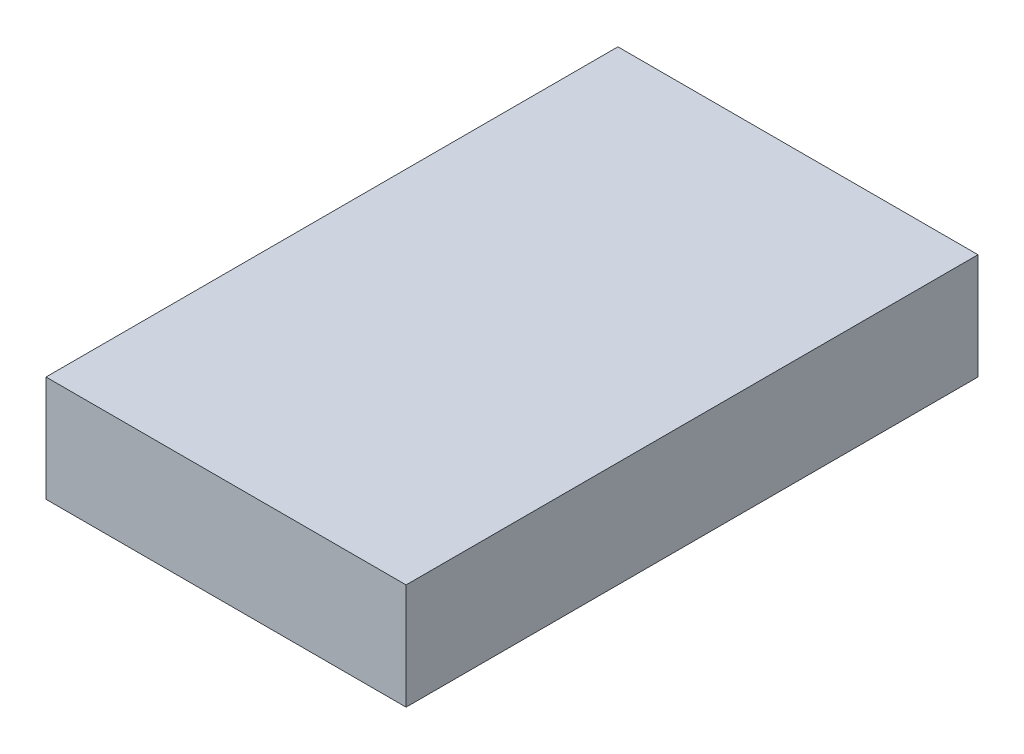
ISO-10303-21;
HEADER;
FILE_DESCRIPTION(('STEP AP214'),'2;1');
FILE_NAME('part.step','',(''),(''),'','','');
FILE_SCHEMA(('AUTOMOTIVE_DESIGN { 1 0 10303 214 1 1 1 1 }'));
ENDSEC;
DATA;
#1=APPLICATION_CONTEXT('core data for automotive mechanical design processes');
#2=APPLICATION_PROTOCOL_DEFINITION('international standard','automotive_design',2000,#1);
#3=PRODUCT_CONTEXT('',#1,'mechanical');
#4=PRODUCT('Part','Part','',(#3));
#5=PRODUCT_RELATED_PRODUCT_CATEGORY('part','',(#4));
#6=PRODUCT_DEFINITION_FORMATION('','',#4);
#7=PRODUCT_DEFINITION_CONTEXT('part definition',#1,'design');
#8=PRODUCT_DEFINITION('design','',#6,#7);
#9=PRODUCT_DEFINITION_SHAPE('','',#8);
#10=(LENGTH_UNIT() NAMED_UNIT(*) SI_UNIT(.MILLI.,.METRE.));
#11=(NAMED_UNIT(*) PLANE_ANGLE_UNIT() SI_UNIT($,.RADIAN.));
#12=(NAMED_UNIT(*) SI_UNIT($,.STERADIAN.) SOLID_ANGLE_UNIT());
#13=UNCERTAINTY_MEASURE_WITH_UNIT(LENGTH_MEASURE(1.E-05),#10,'distance_accuracy_value','');
#14=(GEOMETRIC_REPRESENTATION_CONTEXT(3) GLOBAL_UNCERTAINTY_ASSIGNED_CONTEXT((#13)) GLOBAL_UNIT_ASSIGNED_CONTEXT((#10,
#11,#12)) REPRESENTATION_CONTEXT('',''));
#15=CARTESIAN_POINT('',(0.,0.,0.));
#16=DIRECTION('',(0.,0.,1.));
#17=DIRECTION('',(1.,0.,0.));
#18=AXIS2_PLACEMENT_3D('',#15,#16,#17);
#19=CARTESIAN_POINT('',(0.68,0.4,-1.08));
#20=DIRECTION('',(-1.,0.,0.));
#21=DIRECTION('',(0.,0.,1.));
#22=AXIS2_PLACEMENT_3D('',#19,#20,#21);
#23=PLANE('',#22);
#24=DIRECTION('',(0.,0.,-1.));
#25=VECTOR('',#24,1.);
#26=CARTESIAN_POINT('',(0.68,0.,-1.08));
#27=LINE('',#26,#25);
#28=CARTESIAN_POINT('',(0.68,0.,1.08));
#29=VERTEX_POINT('',#28);
#30=CARTESIAN_POINT('',(0.68,0.,-1.08));
#31=VERTEX_POINT('',#30);
#32=EDGE_CURVE('E99',#29,#31,#27,.T.);
#33=ORIENTED_EDGE('',*,*,#32,.T.);
#34=DIRECTION('',(0.,-1.,0.));
#35=VECTOR('',#34,1.);
#36=CARTESIAN_POINT('',(0.68,0.4,-1.08));
#37=LINE('',#36,#35);
#38=CARTESIAN_POINT('',(0.68,0.4,-1.08));
#39=VERTEX_POINT('',#38);
#40=EDGE_CURVE('E11',#39,#31,#37,.T.);
#41=ORIENTED_EDGE('',*,*,#40,.F.);
#42=DIRECTION('',(0.,0.,-1.));
#43=VECTOR('',#42,1.);
#44=CARTESIAN_POINT('',(0.68,0.4,-1.08));
#45=LINE('',#44,#43);
#46=CARTESIAN_POINT('',(0.68,0.4,1.08));
#47=VERTEX_POINT('',#46);
#48=EDGE_CURVE('E87',#47,#39,#45,.T.);
#49=ORIENTED_EDGE('',*,*,#48,.F.);
#50=DIRECTION('',(0.,-1.,0.));
#51=VECTOR('',#50,1.);
#52=CARTESIAN_POINT('',(0.68,0.4,1.08));
#53=LINE('',#52,#51);
#54=EDGE_CURVE('E95',#47,#29,#53,.T.);
#55=ORIENTED_EDGE('',*,*,#54,.T.);
#56=EDGE_LOOP('',(#33,#41,#49,#55));
#57=FACE_BOUND('',#56,.T.);
#58=ADVANCED_FACE('F36',(#57),#23,.F.);
#59=CARTESIAN_POINT('',(-0.68,0.4,-1.08));
#60=DIRECTION('',(0.,0.,1.));
#61=DIRECTION('',(1.,0.,0.));
#62=AXIS2_PLACEMENT_3D('',#59,#60,#61);
#63=PLANE('',#62);
#64=DIRECTION('',(-1.,0.,0.));
#65=VECTOR('',#64,1.);
#66=CARTESIAN_POINT('',(-0.68,0.,-1.08));
#67=LINE('',#66,#65);
#68=CARTESIAN_POINT('',(-0.68,0.,-1.08));
#69=VERTEX_POINT('',#68);
#70=EDGE_CURVE('E91',#31,#69,#67,.T.);
#71=ORIENTED_EDGE('',*,*,#70,.T.);
#72=DIRECTION('',(0.,-1.,0.));
#73=VECTOR('',#72,1.);
#74=CARTESIAN_POINT('',(-0.68,0.4,-1.08));
#75=LINE('',#74,#73);
#76=CARTESIAN_POINT('',(-0.68,0.4,-1.08));
#77=VERTEX_POINT('',#76);
#78=EDGE_CURVE('E44',#77,#69,#75,.T.);
#79=ORIENTED_EDGE('',*,*,#78,.F.);
#80=DIRECTION('',(-1.,0.,0.));
#81=VECTOR('',#80,1.);
#82=CARTESIAN_POINT('',(-0.68,0.4,-1.08));
#83=LINE('',#82,#81);
#84=EDGE_CURVE('E82',#39,#77,#83,.T.);
#85=ORIENTED_EDGE('',*,*,#84,.F.);
#86=ORIENTED_EDGE('',*,*,#40,.T.);
#87=EDGE_LOOP('',(#71,#79,#85,#86));
#88=FACE_BOUND('',#87,.T.);
#89=ADVANCED_FACE('F90',(#88),#63,.F.);
#90=CARTESIAN_POINT('',(-0.68,0.4,-1.08));
#91=DIRECTION('',(1.,0.,0.));
#92=DIRECTION('',(0.,0.,-1.));
#93=AXIS2_PLACEMENT_3D('',#90,#91,#92);
#94=PLANE('',#93);
#95=DIRECTION('',(0.,0.,1.));
#96=VECTOR('',#95,1.);
#97=CARTESIAN_POINT('',(-0.68,0.,-1.08));
#98=LINE('',#97,#96);
#99=CARTESIAN_POINT('',(-0.68,0.,1.08));
#100=VERTEX_POINT('',#99);
#101=EDGE_CURVE('E69',#69,#100,#98,.T.);
#102=ORIENTED_EDGE('',*,*,#101,.T.);
#103=DIRECTION('',(0.,-1.,0.));
#104=VECTOR('',#103,1.);
#105=CARTESIAN_POINT('',(-0.68,0.4,1.08));
#106=LINE('',#105,#104);
#107=CARTESIAN_POINT('',(-0.68,0.4,1.08));
#108=VERTEX_POINT('',#107);
#109=EDGE_CURVE('E92',#108,#100,#106,.T.);
#110=ORIENTED_EDGE('',*,*,#109,.F.);
#111=DIRECTION('',(0.,0.,1.));
#112=VECTOR('',#111,1.);
#113=CARTESIAN_POINT('',(-0.68,0.4,-1.08));
#114=LINE('',#113,#112);
#115=EDGE_CURVE('E85',#77,#108,#114,.T.);
#116=ORIENTED_EDGE('',*,*,#115,.F.);
#117=ORIENTED_EDGE('',*,*,#78,.T.);
#118=EDGE_LOOP('',(#102,#110,#116,#117));
#119=FACE_BOUND('',#118,.T.);
#120=ADVANCED_FACE('F93',(#119),#94,.F.);
#121=CARTESIAN_POINT('',(-0.68,0.4,1.08));
#122=DIRECTION('',(0.,0.,-1.));
#123=DIRECTION('',(-1.,0.,0.));
#124=AXIS2_PLACEMENT_3D('',#121,#122,#123);
#125=PLANE('',#124);
#126=DIRECTION('',(1.,0.,0.));
#127=VECTOR('',#126,1.);
#128=CARTESIAN_POINT('',(-0.68,0.,1.08));
#129=LINE('',#128,#127);
#130=EDGE_CURVE('E75',#100,#29,#129,.T.);
#131=ORIENTED_EDGE('',*,*,#130,.T.);
#132=ORIENTED_EDGE('',*,*,#54,.F.);
#133=DIRECTION('',(1.,0.,0.));
#134=VECTOR('',#133,1.);
#135=CARTESIAN_POINT('',(-0.68,0.4,1.08));
#136=LINE('',#135,#134);
#137=EDGE_CURVE('E52',#108,#47,#136,.T.);
#138=ORIENTED_EDGE('',*,*,#137,.F.);
#139=ORIENTED_EDGE('',*,*,#109,.T.);
#140=EDGE_LOOP('',(#131,#132,#138,#139));
#141=FACE_BOUND('',#140,.T.);
#142=ADVANCED_FACE('F106',(#141),#125,.F.);
#143=CARTESIAN_POINT('',(0.,0.4,0.));
#144=DIRECTION('',(0.,1.,0.));
#145=DIRECTION('',(0.,0.,1.));
#146=AXIS2_PLACEMENT_3D('',#143,#144,#145);
#147=PLANE('',#146);
#148=ORIENTED_EDGE('',*,*,#48,.T.);
#149=ORIENTED_EDGE('',*,*,#84,.T.);
#150=ORIENTED_EDGE('',*,*,#115,.T.);
#151=ORIENTED_EDGE('',*,*,#137,.T.);
#152=EDGE_LOOP('',(#148,#149,#150,#151));
#153=FACE_BOUND('',#152,.T.);
#154=ADVANCED_FACE('F83',(#153),#147,.T.);
#155=CARTESIAN_POINT('',(0.,0.,0.));
#156=DIRECTION('',(0.,1.,0.));
#157=DIRECTION('',(0.,0.,1.));
#158=AXIS2_PLACEMENT_3D('',#155,#156,#157);
#159=PLANE('',#158);
#160=ORIENTED_EDGE('',*,*,#32,.F.);
#161=ORIENTED_EDGE('',*,*,#130,.F.);
#162=ORIENTED_EDGE('',*,*,#101,.F.);
#163=ORIENTED_EDGE('',*,*,#70,.F.);
#164=EDGE_LOOP('',(#160,#161,#162,#163));
#165=FACE_BOUND('',#164,.T.);
#166=ADVANCED_FACE('F109',(#165),#159,.F.);
#167=CLOSED_SHELL('',(#58,#89,#120,#142,#154,#166));
#168=MANIFOLD_SOLID_BREP('B2',#167);
#169=ADVANCED_BREP_SHAPE_REPRESENTATION('',(#18,#168),#14);
#170=SHAPE_DEFINITION_REPRESENTATION(#9,#169);
ENDSEC;
END-ISO-10303-21;
